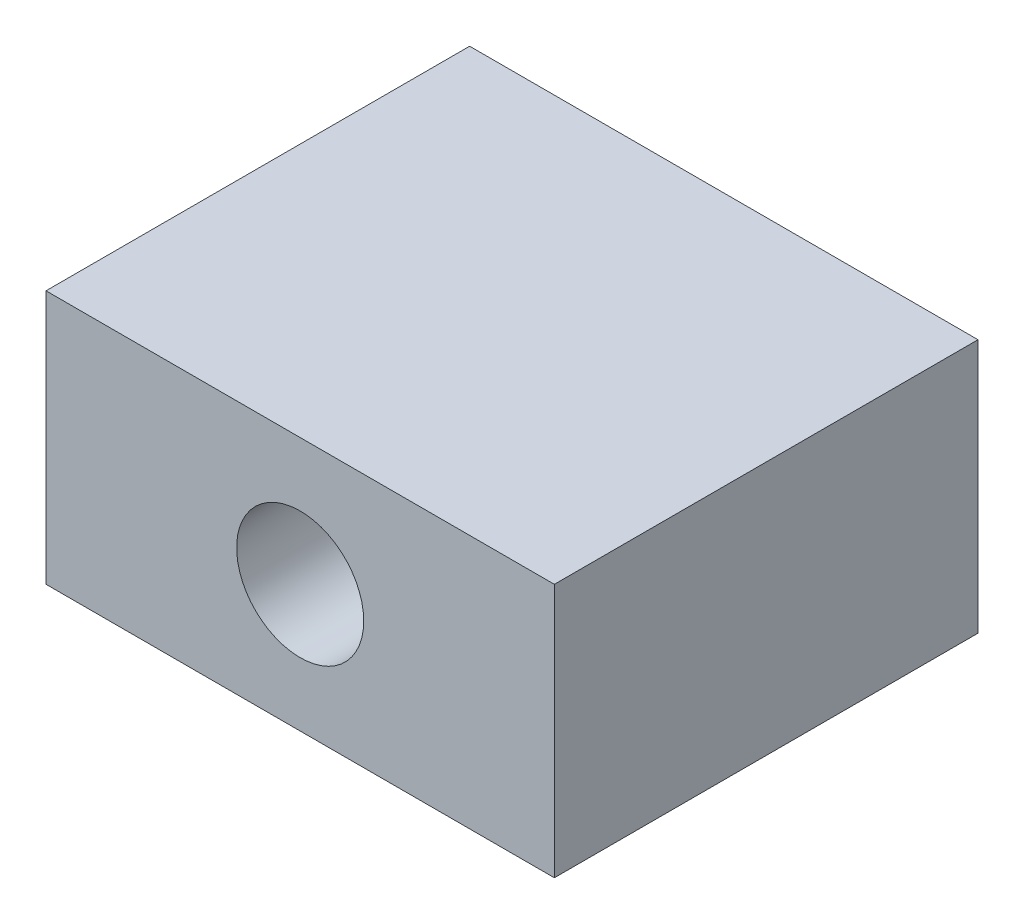
ISO-10303-21;
HEADER;
FILE_DESCRIPTION(('STEP AP214'),'2;1');
FILE_NAME('part.step','',(''),(''),'','','');
FILE_SCHEMA(('AUTOMOTIVE_DESIGN { 1 0 10303 214 1 1 1 1 }'));
ENDSEC;
DATA;
#1=APPLICATION_CONTEXT('core data for automotive mechanical design processes');
#2=APPLICATION_PROTOCOL_DEFINITION('international standard','automotive_design',2000,#1);
#3=PRODUCT_CONTEXT('',#1,'mechanical');
#4=PRODUCT('Part','Part','',(#3));
#5=PRODUCT_RELATED_PRODUCT_CATEGORY('part','',(#4));
#6=PRODUCT_DEFINITION_FORMATION('','',#4);
#7=PRODUCT_DEFINITION_CONTEXT('part definition',#1,'design');
#8=PRODUCT_DEFINITION('design','',#6,#7);
#9=PRODUCT_DEFINITION_SHAPE('','',#8);
#10=(LENGTH_UNIT() NAMED_UNIT(*) SI_UNIT(.MILLI.,.METRE.));
#11=(NAMED_UNIT(*) PLANE_ANGLE_UNIT() SI_UNIT($,.RADIAN.));
#12=(NAMED_UNIT(*) SI_UNIT($,.STERADIAN.) SOLID_ANGLE_UNIT());
#13=UNCERTAINTY_MEASURE_WITH_UNIT(LENGTH_MEASURE(1.E-05),#10,'distance_accuracy_value','');
#14=(GEOMETRIC_REPRESENTATION_CONTEXT(3) GLOBAL_UNCERTAINTY_ASSIGNED_CONTEXT((#13)) GLOBAL_UNIT_ASSIGNED_CONTEXT((#10,
#11,#12)) REPRESENTATION_CONTEXT('',''));
#15=CARTESIAN_POINT('',(0.,0.,0.));
#16=DIRECTION('',(0.,0.,1.));
#17=DIRECTION('',(1.,0.,0.));
#18=AXIS2_PLACEMENT_3D('',#15,#16,#17);
#19=CARTESIAN_POINT('',(280.,0.,25.));
#20=DIRECTION('',(1.,0.,0.));
#21=DIRECTION('',(0.,0.,-1.));
#22=AXIS2_PLACEMENT_3D('',#19,#20,#21);
#23=PLANE('',#22);
#24=DIRECTION('',(0.,-1.,0.));
#25=VECTOR('',#24,1.);
#26=CARTESIAN_POINT('',(280.,0.,-25.));
#27=LINE('',#26,#25);
#28=CARTESIAN_POINT('',(280.,15.,-25.));
#29=VERTEX_POINT('',#28);
#30=CARTESIAN_POINT('',(280.,-15.,-25.));
#31=VERTEX_POINT('',#30);
#32=EDGE_CURVE('E127',#29,#31,#27,.T.);
#33=ORIENTED_EDGE('',*,*,#32,.F.);
#34=DIRECTION('',(0.,0.,-1.));
#35=VECTOR('',#34,1.);
#36=CARTESIAN_POINT('',(280.,15.,25.));
#37=LINE('',#36,#35);
#38=CARTESIAN_POINT('',(280.,15.,25.));
#39=VERTEX_POINT('',#38);
#40=EDGE_CURVE('E11',#39,#29,#37,.T.);
#41=ORIENTED_EDGE('',*,*,#40,.F.);
#42=DIRECTION('',(0.,-1.,0.));
#43=VECTOR('',#42,1.);
#44=CARTESIAN_POINT('',(280.,0.,25.));
#45=LINE('',#44,#43);
#46=CARTESIAN_POINT('',(280.,-15.,25.));
#47=VERTEX_POINT('',#46);
#48=EDGE_CURVE('E113',#39,#47,#45,.T.);
#49=ORIENTED_EDGE('',*,*,#48,.T.);
#50=DIRECTION('',(0.,0.,-1.));
#51=VECTOR('',#50,1.);
#52=CARTESIAN_POINT('',(280.,-15.,25.));
#53=LINE('',#52,#51);
#54=EDGE_CURVE('E89',#47,#31,#53,.T.);
#55=ORIENTED_EDGE('',*,*,#54,.T.);
#56=EDGE_LOOP('',(#33,#41,#49,#55));
#57=FACE_BOUND('',#56,.T.);
#58=ADVANCED_FACE('F41',(#57),#23,.T.);
#59=CARTESIAN_POINT('',(0.,15.,25.));
#60=DIRECTION('',(0.,1.,0.));
#61=DIRECTION('',(0.,0.,1.));
#62=AXIS2_PLACEMENT_3D('',#59,#60,#61);
#63=PLANE('',#62);
#64=DIRECTION('',(1.,0.,0.));
#65=VECTOR('',#64,1.);
#66=CARTESIAN_POINT('',(0.,15.,-25.));
#67=LINE('',#66,#65);
#68=CARTESIAN_POINT('',(220.,15.,-25.));
#69=VERTEX_POINT('',#68);
#70=EDGE_CURVE('E101',#69,#29,#67,.T.);
#71=ORIENTED_EDGE('',*,*,#70,.F.);
#72=DIRECTION('',(0.,0.,-1.));
#73=VECTOR('',#72,1.);
#74=CARTESIAN_POINT('',(220.,15.,25.));
#75=LINE('',#74,#73);
#76=CARTESIAN_POINT('',(220.,15.,25.));
#77=VERTEX_POINT('',#76);
#78=EDGE_CURVE('E57',#77,#69,#75,.T.);
#79=ORIENTED_EDGE('',*,*,#78,.F.);
#80=DIRECTION('',(1.,0.,0.));
#81=VECTOR('',#80,1.);
#82=CARTESIAN_POINT('',(0.,15.,25.));
#83=LINE('',#82,#81);
#84=EDGE_CURVE('E99',#77,#39,#83,.T.);
#85=ORIENTED_EDGE('',*,*,#84,.T.);
#86=ORIENTED_EDGE('',*,*,#40,.T.);
#87=EDGE_LOOP('',(#71,#79,#85,#86));
#88=FACE_BOUND('',#87,.T.);
#89=ADVANCED_FACE('F97',(#88),#63,.T.);
#90=CARTESIAN_POINT('',(220.,0.,25.));
#91=DIRECTION('',(1.,0.,0.));
#92=DIRECTION('',(0.,0.,-1.));
#93=AXIS2_PLACEMENT_3D('',#90,#91,#92);
#94=PLANE('',#93);
#95=CARTESIAN_POINT('',(220.,0.,13.5));
#96=DIRECTION('',(-1.,0.,0.));
#97=DIRECTION('',(0.,0.,1.));
#98=AXIS2_PLACEMENT_3D('',#95,#96,#97);
#99=CIRCLE('',#98,2.5);
#100=CARTESIAN_POINT('',(220.,0.,16.));
#101=VERTEX_POINT('',#100);
#102=EDGE_CURVE('E147',#101,#101,#99,.T.);
#103=ORIENTED_EDGE('',*,*,#102,.F.);
#104=EDGE_LOOP('',(#103));
#105=FACE_BOUND('',#104,.T.);
#106=CARTESIAN_POINT('',(220.,0.,-13.5));
#107=DIRECTION('',(-1.,0.,0.));
#108=DIRECTION('',(0.,0.,1.));
#109=AXIS2_PLACEMENT_3D('',#106,#107,#108);
#110=CIRCLE('',#109,2.5);
#111=CARTESIAN_POINT('',(220.,0.,-11.));
#112=VERTEX_POINT('',#111);
#113=EDGE_CURVE('E235',#112,#112,#110,.T.);
#114=ORIENTED_EDGE('',*,*,#113,.F.);
#115=EDGE_LOOP('',(#114));
#116=FACE_BOUND('',#115,.T.);
#117=DIRECTION('',(0.,-1.,0.));
#118=VECTOR('',#117,1.);
#119=CARTESIAN_POINT('',(220.,0.,-25.));
#120=LINE('',#119,#118);
#121=CARTESIAN_POINT('',(220.,-15.,-25.));
#122=VERTEX_POINT('',#121);
#123=EDGE_CURVE('E132',#69,#122,#120,.T.);
#124=ORIENTED_EDGE('',*,*,#123,.T.);
#125=DIRECTION('',(0.,0.,-1.));
#126=VECTOR('',#125,1.);
#127=CARTESIAN_POINT('',(220.,-15.,25.));
#128=LINE('',#127,#126);
#129=CARTESIAN_POINT('',(220.,-15.,25.));
#130=VERTEX_POINT('',#129);
#131=EDGE_CURVE('E105',#130,#122,#128,.T.);
#132=ORIENTED_EDGE('',*,*,#131,.F.);
#133=DIRECTION('',(0.,-1.,0.));
#134=VECTOR('',#133,1.);
#135=CARTESIAN_POINT('',(220.,0.,25.));
#136=LINE('',#135,#134);
#137=EDGE_CURVE('E108',#77,#130,#136,.T.);
#138=ORIENTED_EDGE('',*,*,#137,.F.);
#139=ORIENTED_EDGE('',*,*,#78,.T.);
#140=EDGE_LOOP('',(#124,#132,#138,#139));
#141=FACE_BOUND('',#140,.T.);
#142=ADVANCED_FACE('F109',(#105,#116,#141),#94,.F.);
#143=CARTESIAN_POINT('',(250.,0.,25.));
#144=DIRECTION('',(0.,0.,-1.));
#145=DIRECTION('',(-1.,0.,0.));
#146=AXIS2_PLACEMENT_3D('',#143,#144,#145);
#147=CYLINDRICAL_SURFACE('',#146,7.50000000000001);
#148=CARTESIAN_POINT('',(242.5,0.,16.));
#149=CARTESIAN_POINT('',(242.499999617476,-0.136408407216808,16.0000006343291));
#150=CARTESIAN_POINT('',(242.503755762311,-0.272812986346374,15.988799334682));
#151=CARTESIAN_POINT('',(242.518369744918,-0.54160440218243,15.944427227957));
#152=CARTESIAN_POINT('',(242.529228319946,-0.673990820297045,15.9112541401277));
#153=CARTESIAN_POINT('',(242.556867302339,-0.930831973754438,15.8242018915399));
#154=CARTESIAN_POINT('',(242.573637806729,-1.05529956471508,15.7703573438518));
#155=CARTESIAN_POINT('',(242.611388857066,-1.29343734201331,15.6436470679041));
#156=CARTESIAN_POINT('',(242.632370233306,-1.40710539239676,15.5707775874935));
#157=CARTESIAN_POINT('',(242.677147638925,-1.62435418755566,15.4054354878531));
#158=CARTESIAN_POINT('',(242.701011088405,-1.72750925074577,15.3124219143488));
#159=CARTESIAN_POINT('',(242.748492130422,-1.91708173175521,15.1105821132336));
#160=CARTESIAN_POINT('',(242.772109667736,-2.00349546372365,15.0017524126787));
#161=CARTESIAN_POINT('',(242.817166688068,-2.15956235556964,14.7675372120089));
#162=CARTESIAN_POINT('',(242.838524018108,-2.22866214555258,14.6417656506697));
#163=CARTESIAN_POINT('',(242.875617364535,-2.3445471846943,14.3795597638536));
#164=CARTESIAN_POINT('',(242.891355095981,-2.39133924346691,14.2431287070931));
#165=CARTESIAN_POINT('',(242.914717418266,-2.45968365377291,13.9683169462582));
#166=CARTESIAN_POINT('',(242.92259760576,-2.48203362067942,13.8301569787773));
#167=CARTESIAN_POINT('',(242.930108584262,-2.50335280833619,13.5518406146103));
#168=CARTESIAN_POINT('',(242.929741924432,-2.5023292540118,13.411684848227));
#169=CARTESIAN_POINT('',(242.921024624795,-2.47754975925855,13.1401584238899));
#170=CARTESIAN_POINT('',(242.913039603312,-2.45483478291749,13.0086789927025));
#171=CARTESIAN_POINT('',(242.890583556886,-2.38901540712354,12.7515164509829));
#172=CARTESIAN_POINT('',(242.876111755397,-2.34590856647968,12.6258340364123));
#173=CARTESIAN_POINT('',(242.842052221719,-2.23984764515053,12.3814681260213));
#174=CARTESIAN_POINT('',(242.822385855172,-2.17658512176816,12.2629299363262));
#175=CARTESIAN_POINT('',(242.780186035607,-2.03222276575785,12.0378227293007));
#176=CARTESIAN_POINT('',(242.757651755238,-1.95111778091001,11.9312571826665));
#177=CARTESIAN_POINT('',(242.710816770806,-1.76837333170559,11.7272710045981));
#178=CARTESIAN_POINT('',(242.686485266129,-1.66588287519077,11.6306182637273));
#179=CARTESIAN_POINT('',(242.639826540324,-1.44584892492516,11.4556718333415));
#180=CARTESIAN_POINT('',(242.617499511548,-1.32830398915203,11.3773799045888));
#181=CARTESIAN_POINT('',(242.577072301555,-1.07986903261567,11.2407592494123));
#182=CARTESIAN_POINT('',(242.559016249799,-0.948858191040839,11.1826362716482));
#183=CARTESIAN_POINT('',(242.529485821389,-0.678172708411266,11.0894920651107));
#184=CARTESIAN_POINT('',(242.518009158628,-0.538501095387381,11.0544628114414));
#185=CARTESIAN_POINT('',(242.503309323214,-0.260959573823258,11.0098608349441));
#186=CARTESIAN_POINT('',(242.499749954157,-0.123273999662114,10.9992504770681));
#187=CARTESIAN_POINT('',(242.500277432629,0.151937674900595,11.0008316839962));
#188=CARTESIAN_POINT('',(242.504362989516,0.289463798299127,11.0130193999497));
#189=CARTESIAN_POINT('',(242.519499382072,0.55629966576064,11.0590297693399));
#190=CARTESIAN_POINT('',(242.53034503222,0.685732017087109,11.0922155151237));
#191=CARTESIAN_POINT('',(242.557703829248,0.937139896448934,11.1784836111668));
#192=CARTESIAN_POINT('',(242.574217698833,1.05911447127152,11.2315684986695));
#193=CARTESIAN_POINT('',(242.611776717818,1.29572074098318,11.357676079602));
#194=CARTESIAN_POINT('',(242.632929631105,1.41007489804287,11.4311864832079));
#195=CARTESIAN_POINT('',(242.677368652093,1.62516207533896,11.5954853750337));
#196=CARTESIAN_POINT('',(242.700655410154,1.72589091948894,11.6862791400794));
#197=CARTESIAN_POINT('',(242.748078800489,1.91563126951575,11.8874468775165));
#198=CARTESIAN_POINT('',(242.772205972814,2.00390242311443,11.9985230673172));
#199=CARTESIAN_POINT('',(242.817500667632,2.16064380580894,12.2344289195272));
#200=CARTESIAN_POINT('',(242.83866816545,2.22911386982753,12.3592586965852));
#201=CARTESIAN_POINT('',(242.875440205215,2.3439923260409,12.6191825382247));
#202=CARTESIAN_POINT('',(242.891055980176,2.39044533041255,12.7542551979219));
#203=CARTESIAN_POINT('',(242.914729192339,2.45973666689839,13.0309466251103));
#204=CARTESIAN_POINT('',(242.922790034409,2.48258563738485,13.1725624135109));
#205=CARTESIAN_POINT('',(242.930053528146,2.50319070619335,13.4504927401023));
#206=CARTESIAN_POINT('',(242.929689993565,2.502175643271,13.5867058507171));
#207=CARTESIAN_POINT('',(242.921218254403,2.47810573362173,13.8569126873052));
#208=CARTESIAN_POINT('',(242.913110510766,2.45505219864646,13.9909065448877));
#209=CARTESIAN_POINT('',(242.890386892378,2.38842953282336,14.2503391575062));
#210=CARTESIAN_POINT('',(242.875897549438,2.34525836503878,14.3758920625112));
#211=CARTESIAN_POINT('',(242.842090029538,2.23994841439937,14.6180685173457));
#212=CARTESIAN_POINT('',(242.822770780915,2.17780542138451,14.73469007797));
#213=CARTESIAN_POINT('',(242.780429269349,2.03315173145857,14.9612091748073));
#214=CARTESIAN_POINT('',(242.757282208947,1.94987060691145,15.070591254746));
#215=CARTESIAN_POINT('',(242.710416092919,1.76660720783912,15.2742245334605));
#216=CARTESIAN_POINT('',(242.686696877191,1.6666202111287,15.3684714392202));
#217=CARTESIAN_POINT('',(242.640249236861,1.44810389230172,15.5428610307229));
#218=CARTESIAN_POINT('',(242.617595454969,1.32900378374932,15.6223108693775));
#219=CARTESIAN_POINT('',(242.576850220685,1.07839339351656,15.7599760721266));
#220=CARTESIAN_POINT('',(242.558757602302,0.946886295330873,15.8181968648051));
#221=CARTESIAN_POINT('',(242.529862123286,0.681234118002443,15.9093040812217));
#222=CARTESIAN_POINT('',(242.518769689437,0.547469394191024,15.9432061656584));
#223=CARTESIAN_POINT('',(242.503839823394,0.275801040025619,15.9885507016928));
#224=CARTESIAN_POINT('',(242.500000386702,0.137898563921867,15.9999993587413));
#225=CARTESIAN_POINT('',(242.5,0.,16.));
#226=B_SPLINE_CURVE_WITH_KNOTS('',3,(#148,#149,#150,#151,#152,#153,#154,#155,#156,#157,#158,
#159,#160,#161,#162,#163,#164,#165,#166,#167,#168,#169,#170,#171,#172,#173,#174,#175,#176,#177,
#178,#179,#180,#181,#182,#183,#184,#185,#186,#187,#188,#189,#190,#191,#192,#193,#194,#195,#196,
#197,#198,#199,#200,#201,#202,#203,#204,#205,#206,#207,#208,#209,#210,#211,#212,#213,#214,#215,
#216,#217,#218,#219,#220,#221,#222,#223,#224,#225),.UNSPECIFIED.,.T.,.F.,(4,2,2,2,2,2,2,2,2,2,2,
2,2,2,2,2,2,2,2,2,2,2,2,2,2,2,2,2,2,2,2,2,2,2,2,2,2,2,4),(0.,0.408717765065027,0.8174779631688,
1.22555668217568,1.63371594449775,2.05461710706889,2.47561083218825,2.90870962058676,
3.34167611732083,3.760048143546,4.17829084968713,4.57742066378201,4.97659827138705,
5.38220427887827,5.78792756395518,6.21483264528418,6.64177864916546,7.07296014125894,
7.50399172193021,7.91633957937924,8.32861782910441,8.72895394945534,9.1293411321026,
9.54025999609341,9.95130452054728,10.3810255720188,10.8107502058749,11.2396003456693,
11.668257117646,12.0748916516065,12.4815019837844,12.8803896770104,13.2793659543994,
13.6957516672951,14.1122552780945,14.5449915208775,14.9776170288114,15.3909139593453,
15.8040966509535),.UNSPECIFIED.);
#227=CARTESIAN_POINT('',(242.5,0.,16.));
#228=VERTEX_POINT('',#227);
#229=EDGE_CURVE('E46',#228,#228,#226,.T.);
#230=ORIENTED_EDGE('',*,*,#229,.F.);
#231=EDGE_LOOP('',(#230));
#232=FACE_BOUND('',#231,.T.);
#233=CARTESIAN_POINT('',(242.5,0.,-11.));
#234=CARTESIAN_POINT('',(242.499999617476,-0.136408407216808,-10.9999993656709));
#235=CARTESIAN_POINT('',(242.503755762311,-0.272812986346374,-11.011200665318));
#236=CARTESIAN_POINT('',(242.518369744918,-0.54160440218243,-11.055572772043));
#237=CARTESIAN_POINT('',(242.529228319946,-0.673990820297045,-11.0887458598723));
#238=CARTESIAN_POINT('',(242.556867302339,-0.930831973754438,-11.1757981084601));
#239=CARTESIAN_POINT('',(242.573637806729,-1.05529956471508,-11.2296426561482));
#240=CARTESIAN_POINT('',(242.611388857066,-1.2934373420133,-11.3563529320959));
#241=CARTESIAN_POINT('',(242.632370233306,-1.40710539239676,-11.4292224125065));
#242=CARTESIAN_POINT('',(242.677147638925,-1.62435418755566,-11.5945645121469));
#243=CARTESIAN_POINT('',(242.701011088405,-1.72750925074577,-11.6875780856512));
#244=CARTESIAN_POINT('',(242.748492130422,-1.91708173175521,-11.8894178867664));
#245=CARTESIAN_POINT('',(242.772109667736,-2.00349546372365,-11.9982475873213));
#246=CARTESIAN_POINT('',(242.817166688068,-2.15956235556964,-12.2324627879911));
#247=CARTESIAN_POINT('',(242.838524018108,-2.22866214555257,-12.3582343493303));
#248=CARTESIAN_POINT('',(242.875617364535,-2.3445471846943,-12.6204402361464));
#249=CARTESIAN_POINT('',(242.891355095981,-2.39133924346691,-12.7568712929069));
#250=CARTESIAN_POINT('',(242.914717418266,-2.45968365377291,-13.0316830537418));
#251=CARTESIAN_POINT('',(242.92259760576,-2.48203362067942,-13.1698430212227));
#252=CARTESIAN_POINT('',(242.930108584262,-2.50335280833619,-13.4481593853897));
#253=CARTESIAN_POINT('',(242.929741924432,-2.5023292540118,-13.588315151773));
#254=CARTESIAN_POINT('',(242.921024624795,-2.47754975925855,-13.8598415761101));
#255=CARTESIAN_POINT('',(242.913039603312,-2.45483478291749,-13.9913210072975));
#256=CARTESIAN_POINT('',(242.890583556886,-2.38901540712354,-14.2484835490171));
#257=CARTESIAN_POINT('',(242.876111755397,-2.34590856647968,-14.3741659635877));
#258=CARTESIAN_POINT('',(242.842052221719,-2.23984764515053,-14.6185318739787));
#259=CARTESIAN_POINT('',(242.822385855172,-2.17658512176815,-14.7370700636738));
#260=CARTESIAN_POINT('',(242.780186035607,-2.03222276575785,-14.9621772706993));
#261=CARTESIAN_POINT('',(242.757651755238,-1.95111778091001,-15.0687428173335));
#262=CARTESIAN_POINT('',(242.710816770806,-1.76837333170559,-15.2727289954019));
#263=CARTESIAN_POINT('',(242.686485266129,-1.66588287519077,-15.3693817362727));
#264=CARTESIAN_POINT('',(242.639826540324,-1.44584892492516,-15.5443281666585));
#265=CARTESIAN_POINT('',(242.617499511548,-1.32830398915203,-15.6226200954112));
#266=CARTESIAN_POINT('',(242.577072301555,-1.07986903261567,-15.7592407505877));
#267=CARTESIAN_POINT('',(242.559016249799,-0.948858191040838,-15.8173637283518));
#268=CARTESIAN_POINT('',(242.529485821389,-0.678172708411264,-15.9105079348893));
#269=CARTESIAN_POINT('',(242.518009158628,-0.53850109538738,-15.9455371885586));
#270=CARTESIAN_POINT('',(242.503309323214,-0.260959573823257,-15.9901391650559));
#271=CARTESIAN_POINT('',(242.499749954157,-0.123273999662112,-16.0007495229319));
#272=CARTESIAN_POINT('',(242.500277432629,0.151937674900596,-15.9991683160038));
#273=CARTESIAN_POINT('',(242.504362989516,0.289463798299128,-15.9869806000503));
#274=CARTESIAN_POINT('',(242.519499382072,0.55629966576064,-15.9409702306601));
#275=CARTESIAN_POINT('',(242.53034503222,0.685732017087109,-15.9077844848763));
#276=CARTESIAN_POINT('',(242.557703829248,0.937139896448935,-15.8215163888332));
#277=CARTESIAN_POINT('',(242.574217698833,1.05911447127152,-15.7684315013305));
#278=CARTESIAN_POINT('',(242.611776717818,1.29572074098318,-15.642323920398));
#279=CARTESIAN_POINT('',(242.632929631105,1.41007489804287,-15.5688135167921));
#280=CARTESIAN_POINT('',(242.677368652093,1.62516207533897,-15.4045146249663));
#281=CARTESIAN_POINT('',(242.700655410154,1.72589091948894,-15.3137208599206));
#282=CARTESIAN_POINT('',(242.748078800489,1.91563126951575,-15.1125531224835));
#283=CARTESIAN_POINT('',(242.772205972814,2.00390242311443,-15.0014769326828));
#284=CARTESIAN_POINT('',(242.817500667632,2.16064380580894,-14.7655710804728));
#285=CARTESIAN_POINT('',(242.83866816545,2.22911386982753,-14.6407413034148));
#286=CARTESIAN_POINT('',(242.875440205215,2.3439923260409,-14.3808174617753));
#287=CARTESIAN_POINT('',(242.891055980176,2.39044533041255,-14.2457448020781));
#288=CARTESIAN_POINT('',(242.914729192339,2.45973666689839,-13.9690533748897));
#289=CARTESIAN_POINT('',(242.922790034409,2.48258563738485,-13.8274375864891));
#290=CARTESIAN_POINT('',(242.930053528146,2.50319070619335,-13.5495072598977));
#291=CARTESIAN_POINT('',(242.929689993565,2.502175643271,-13.4132941492829));
#292=CARTESIAN_POINT('',(242.921218254403,2.47810573362173,-13.1430873126948));
#293=CARTESIAN_POINT('',(242.913110510766,2.45505219864646,-13.0090934551123));
#294=CARTESIAN_POINT('',(242.890386892378,2.38842953282336,-12.7496608424938));
#295=CARTESIAN_POINT('',(242.875897549438,2.34525836503878,-12.6241079374888));
#296=CARTESIAN_POINT('',(242.842090029538,2.23994841439937,-12.3819314826543));
#297=CARTESIAN_POINT('',(242.822770780915,2.17780542138451,-12.26530992203));
#298=CARTESIAN_POINT('',(242.780429269349,2.03315173145857,-12.0387908251927));
#299=CARTESIAN_POINT('',(242.757282208947,1.94987060691145,-11.929408745254));
#300=CARTESIAN_POINT('',(242.710416092919,1.76660720783912,-11.7257754665395));
#301=CARTESIAN_POINT('',(242.686696877191,1.6666202111287,-11.6315285607798));
#302=CARTESIAN_POINT('',(242.640249236861,1.44810389230171,-11.4571389692771));
#303=CARTESIAN_POINT('',(242.617595454969,1.32900378374931,-11.3776891306225));
#304=CARTESIAN_POINT('',(242.576850220685,1.07839339351656,-11.2400239278734));
#305=CARTESIAN_POINT('',(242.558757602302,0.946886295330869,-11.1818031351949));
#306=CARTESIAN_POINT('',(242.529862123286,0.68123411800244,-11.0906959187783));
#307=CARTESIAN_POINT('',(242.518769689437,0.547469394191023,-11.0567938343416));
#308=CARTESIAN_POINT('',(242.503839823394,0.275801040025618,-11.0114492983072));
#309=CARTESIAN_POINT('',(242.500000386702,0.137898563921866,-11.0000006412587));
#310=CARTESIAN_POINT('',(242.5,0.,-11.));
#311=B_SPLINE_CURVE_WITH_KNOTS('',3,(#233,#234,#235,#236,#237,#238,#239,#240,#241,#242,#243,
#244,#245,#246,#247,#248,#249,#250,#251,#252,#253,#254,#255,#256,#257,#258,#259,#260,#261,#262,
#263,#264,#265,#266,#267,#268,#269,#270,#271,#272,#273,#274,#275,#276,#277,#278,#279,#280,#281,
#282,#283,#284,#285,#286,#287,#288,#289,#290,#291,#292,#293,#294,#295,#296,#297,#298,#299,#300,
#301,#302,#303,#304,#305,#306,#307,#308,#309,#310),.UNSPECIFIED.,.T.,.F.,(4,2,2,2,2,2,2,2,2,2,2,
2,2,2,2,2,2,2,2,2,2,2,2,2,2,2,2,2,2,2,2,2,2,2,2,2,2,2,4),(0.,0.408717765065027,
0.817477963168801,1.22555668217567,1.63371594449775,2.05461710706889,2.47561083218825,
2.90870962058675,3.34167611732083,3.760048143546,4.17829084968714,4.57742066378201,
4.97659827138705,5.38220427887827,5.78792756395518,6.21483264528418,6.64177864916546,
7.07296014125894,7.50399172193021,7.91633957937924,8.32861782910442,8.72895394945534,
9.1293411321026,9.54025999609341,9.95130452054728,10.3810255720188,10.8107502058749,
11.2396003456693,11.668257117646,12.0748916516065,12.4815019837844,12.8803896770104,
13.2793659543994,13.6957516672951,14.1122552780945,14.5449915208775,14.9776170288114,
15.3909139593453,15.8040966509535),.UNSPECIFIED.);
#312=CARTESIAN_POINT('',(242.5,0.,-11.));
#313=VERTEX_POINT('',#312);
#314=EDGE_CURVE('E140',#313,#313,#311,.T.);
#315=ORIENTED_EDGE('',*,*,#314,.F.);
#316=EDGE_LOOP('',(#315));
#317=FACE_BOUND('',#316,.T.);
#318=CARTESIAN_POINT('',(250.,0.,25.));
#319=DIRECTION('',(0.,0.,1.));
#320=DIRECTION('',(1.,0.,0.));
#321=AXIS2_PLACEMENT_3D('',#318,#319,#320);
#322=CIRCLE('',#321,7.50000000000001);
#323=CARTESIAN_POINT('',(257.5,0.,25.));
#324=VERTEX_POINT('',#323);
#325=EDGE_CURVE('E117',#324,#324,#322,.T.);
#326=ORIENTED_EDGE('',*,*,#325,.T.);
#327=EDGE_LOOP('',(#326));
#328=FACE_BOUND('',#327,.T.);
#329=CARTESIAN_POINT('',(250.,0.,-25.));
#330=DIRECTION('',(0.,0.,1.));
#331=DIRECTION('',(1.,0.,0.));
#332=AXIS2_PLACEMENT_3D('',#329,#330,#331);
#333=CIRCLE('',#332,7.50000000000001);
#334=CARTESIAN_POINT('',(257.5,0.,-25.));
#335=VERTEX_POINT('',#334);
#336=EDGE_CURVE('E123',#335,#335,#333,.T.);
#337=ORIENTED_EDGE('',*,*,#336,.F.);
#338=EDGE_LOOP('',(#337));
#339=FACE_BOUND('',#338,.T.);
#340=ADVANCED_FACE('F43',(#232,#317,#328,#339),#147,.F.);
#341=CARTESIAN_POINT('',(0.,-15.,25.));
#342=DIRECTION('',(0.,1.,0.));
#343=DIRECTION('',(0.,0.,1.));
#344=AXIS2_PLACEMENT_3D('',#341,#342,#343);
#345=PLANE('',#344);
#346=DIRECTION('',(1.,0.,0.));
#347=VECTOR('',#346,1.);
#348=CARTESIAN_POINT('',(0.,-15.,-25.));
#349=LINE('',#348,#347);
#350=EDGE_CURVE('E82',#122,#31,#349,.T.);
#351=ORIENTED_EDGE('',*,*,#350,.T.);
#352=ORIENTED_EDGE('',*,*,#54,.F.);
#353=DIRECTION('',(1.,0.,0.));
#354=VECTOR('',#353,1.);
#355=CARTESIAN_POINT('',(0.,-15.,25.));
#356=LINE('',#355,#354);
#357=EDGE_CURVE('E66',#130,#47,#356,.T.);
#358=ORIENTED_EDGE('',*,*,#357,.F.);
#359=ORIENTED_EDGE('',*,*,#131,.T.);
#360=EDGE_LOOP('',(#351,#352,#358,#359));
#361=FACE_BOUND('',#360,.T.);
#362=ADVANCED_FACE('F158',(#361),#345,.F.);
#363=CARTESIAN_POINT('',(0.,0.,25.));
#364=DIRECTION('',(0.,0.,1.));
#365=DIRECTION('',(1.,0.,0.));
#366=AXIS2_PLACEMENT_3D('',#363,#364,#365);
#367=PLANE('',#366);
#368=ORIENTED_EDGE('',*,*,#325,.F.);
#369=EDGE_LOOP('',(#368));
#370=FACE_BOUND('',#369,.T.);
#371=ORIENTED_EDGE('',*,*,#48,.F.);
#372=ORIENTED_EDGE('',*,*,#84,.F.);
#373=ORIENTED_EDGE('',*,*,#137,.T.);
#374=ORIENTED_EDGE('',*,*,#357,.T.);
#375=EDGE_LOOP('',(#371,#372,#373,#374));
#376=FACE_BOUND('',#375,.T.);
#377=ADVANCED_FACE('F112',(#370,#376),#367,.T.);
#378=CARTESIAN_POINT('',(0.,0.,-25.));
#379=DIRECTION('',(0.,0.,1.));
#380=DIRECTION('',(1.,0.,0.));
#381=AXIS2_PLACEMENT_3D('',#378,#379,#380);
#382=PLANE('',#381);
#383=ORIENTED_EDGE('',*,*,#336,.T.);
#384=EDGE_LOOP('',(#383));
#385=FACE_BOUND('',#384,.T.);
#386=ORIENTED_EDGE('',*,*,#32,.T.);
#387=ORIENTED_EDGE('',*,*,#350,.F.);
#388=ORIENTED_EDGE('',*,*,#123,.F.);
#389=ORIENTED_EDGE('',*,*,#70,.T.);
#390=EDGE_LOOP('',(#386,#387,#388,#389));
#391=FACE_BOUND('',#390,.T.);
#392=ADVANCED_FACE('F153',(#385,#391),#382,.F.);
#393=CARTESIAN_POINT('',(250.,0.,-13.5));
#394=DIRECTION('',(-1.,0.,0.));
#395=DIRECTION('',(0.,0.,1.));
#396=AXIS2_PLACEMENT_3D('',#393,#394,#395);
#397=CYLINDRICAL_SURFACE('',#396,2.5);
#398=ORIENTED_EDGE('',*,*,#314,.T.);
#399=EDGE_LOOP('',(#398));
#400=FACE_BOUND('',#399,.T.);
#401=ORIENTED_EDGE('',*,*,#113,.T.);
#402=EDGE_LOOP('',(#401));
#403=FACE_BOUND('',#402,.T.);
#404=ADVANCED_FACE('F148',(#400,#403),#397,.F.);
#405=CARTESIAN_POINT('',(250.,0.,13.5));
#406=DIRECTION('',(-1.,0.,0.));
#407=DIRECTION('',(0.,0.,1.));
#408=AXIS2_PLACEMENT_3D('',#405,#406,#407);
#409=CYLINDRICAL_SURFACE('',#408,2.5);
#410=ORIENTED_EDGE('',*,*,#229,.T.);
#411=EDGE_LOOP('',(#410));
#412=FACE_BOUND('',#411,.T.);
#413=ORIENTED_EDGE('',*,*,#102,.T.);
#414=EDGE_LOOP('',(#413));
#415=FACE_BOUND('',#414,.T.);
#416=ADVANCED_FACE('F152',(#412,#415),#409,.F.);
#417=CLOSED_SHELL('',(#58,#89,#142,#340,#362,#377,#392,#404,#416));
#418=MANIFOLD_SOLID_BREP('B2',#417);
#419=ADVANCED_BREP_SHAPE_REPRESENTATION('',(#18,#418),#14);
#420=SHAPE_DEFINITION_REPRESENTATION(#9,#419);
ENDSEC;
END-ISO-10303-21;
